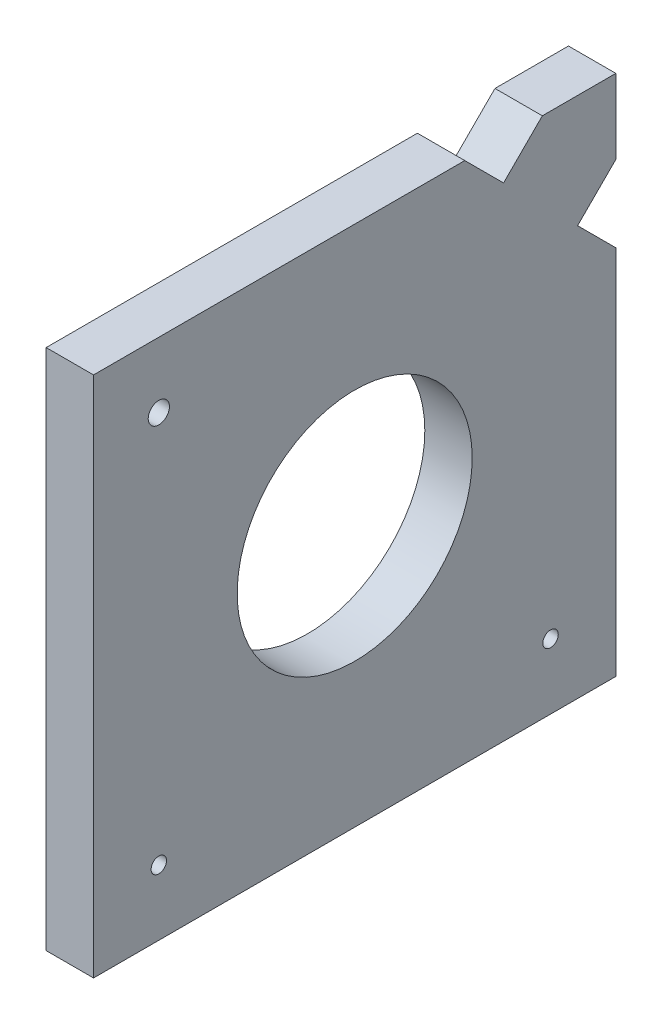
ISO-10303-21;
HEADER;
FILE_DESCRIPTION(('STEP AP214'),'2;1');
FILE_NAME('part.step','',(''),(''),'','','');
FILE_SCHEMA(('AUTOMOTIVE_DESIGN { 1 0 10303 214 1 1 1 1 }'));
ENDSEC;
DATA;
#1=APPLICATION_CONTEXT('core data for automotive mechanical design processes');
#2=APPLICATION_PROTOCOL_DEFINITION('international standard','automotive_design',2000,#1);
#3=PRODUCT_CONTEXT('',#1,'mechanical');
#4=PRODUCT('Part','Part','',(#3));
#5=PRODUCT_RELATED_PRODUCT_CATEGORY('part','',(#4));
#6=PRODUCT_DEFINITION_FORMATION('','',#4);
#7=PRODUCT_DEFINITION_CONTEXT('part definition',#1,'design');
#8=PRODUCT_DEFINITION('design','',#6,#7);
#9=PRODUCT_DEFINITION_SHAPE('','',#8);
#10=(LENGTH_UNIT() NAMED_UNIT(*) SI_UNIT(.MILLI.,.METRE.));
#11=(NAMED_UNIT(*) PLANE_ANGLE_UNIT() SI_UNIT($,.RADIAN.));
#12=(NAMED_UNIT(*) SI_UNIT($,.STERADIAN.) SOLID_ANGLE_UNIT());
#13=UNCERTAINTY_MEASURE_WITH_UNIT(LENGTH_MEASURE(1.E-05),#10,'distance_accuracy_value','');
#14=(GEOMETRIC_REPRESENTATION_CONTEXT(3) GLOBAL_UNCERTAINTY_ASSIGNED_CONTEXT((#13)) GLOBAL_UNIT_ASSIGNED_CONTEXT((#10,
#11,#12)) REPRESENTATION_CONTEXT('',''));
#15=CARTESIAN_POINT('',(0.,0.,0.));
#16=DIRECTION('',(0.,0.,1.));
#17=DIRECTION('',(1.,0.,0.));
#18=AXIS2_PLACEMENT_3D('',#15,#16,#17);
#19=CARTESIAN_POINT('',(6.35,0.,0.));
#20=DIRECTION('',(-1.,0.,0.));
#21=DIRECTION('',(0.,0.,1.));
#22=AXIS2_PLACEMENT_3D('',#19,#20,#21);
#23=PLANE('',#22);
#24=CARTESIAN_POINT('',(6.35,8.75000000000001,-61.25));
#25=DIRECTION('',(1.,0.,0.));
#26=DIRECTION('',(0.,0.,-1.));
#27=AXIS2_PLACEMENT_3D('',#24,#25,#26);
#28=CIRCLE('',#27,1.03251);
#29=CARTESIAN_POINT('',(6.35,8.75000000000001,-62.28251));
#30=VERTEX_POINT('',#29);
#31=EDGE_CURVE('E229',#30,#30,#28,.T.);
#32=ORIENTED_EDGE('',*,*,#31,.F.);
#33=EDGE_LOOP('',(#32));
#34=FACE_BOUND('',#33,.T.);
#35=CARTESIAN_POINT('',(6.35,8.75000000000001,-8.74999999999999));
#36=DIRECTION('',(1.,0.,0.));
#37=DIRECTION('',(0.,0.,1.));
#38=AXIS2_PLACEMENT_3D('',#35,#36,#37);
#39=CIRCLE('',#38,1.03251);
#40=CARTESIAN_POINT('',(6.35,8.75000000000001,-7.71748999999999));
#41=VERTEX_POINT('',#40);
#42=EDGE_CURVE('E223',#41,#41,#39,.T.);
#43=ORIENTED_EDGE('',*,*,#42,.F.);
#44=EDGE_LOOP('',(#43));
#45=FACE_BOUND('',#44,.T.);
#46=CARTESIAN_POINT('',(6.35,61.25,-8.74999999999999));
#47=DIRECTION('',(1.,0.,0.));
#48=DIRECTION('',(0.,0.,-1.));
#49=AXIS2_PLACEMENT_3D('',#46,#47,#48);
#50=CIRCLE('',#49,1.4224);
#51=CARTESIAN_POINT('',(6.35,61.25,-10.1724));
#52=VERTEX_POINT('',#51);
#53=EDGE_CURVE('E217',#52,#52,#50,.T.);
#54=ORIENTED_EDGE('',*,*,#53,.F.);
#55=EDGE_LOOP('',(#54));
#56=FACE_BOUND('',#55,.T.);
#57=DIRECTION('',(0.,-1.,0.));
#58=VECTOR('',#57,1.);
#59=CARTESIAN_POINT('',(6.35,0.,0.));
#60=LINE('',#59,#58);
#61=CARTESIAN_POINT('',(6.35,70.,0.));
#62=VERTEX_POINT('',#61);
#63=CARTESIAN_POINT('',(6.35,0.,0.));
#64=VERTEX_POINT('',#63);
#65=EDGE_CURVE('E163',#62,#64,#60,.T.);
#66=ORIENTED_EDGE('',*,*,#65,.T.);
#67=DIRECTION('',(0.,0.,-1.));
#68=VECTOR('',#67,1.);
#69=CARTESIAN_POINT('',(6.35,0.,0.));
#70=LINE('',#69,#68);
#71=CARTESIAN_POINT('',(6.35,0.,-70.));
#72=VERTEX_POINT('',#71);
#73=EDGE_CURVE('E101',#64,#72,#70,.T.);
#74=ORIENTED_EDGE('',*,*,#73,.T.);
#75=DIRECTION('',(0.,1.,0.));
#76=VECTOR('',#75,1.);
#77=CARTESIAN_POINT('',(6.35,49.7566150142179,-70.));
#78=LINE('',#77,#76);
#79=CARTESIAN_POINT('',(6.35,49.7566150142179,-70.));
#80=VERTEX_POINT('',#79);
#81=EDGE_CURVE('E184',#72,#80,#78,.T.);
#82=ORIENTED_EDGE('',*,*,#81,.T.);
#83=DIRECTION('',(0.,0.707106781186539,0.707106781186556));
#84=VECTOR('',#83,1.);
#85=CARTESIAN_POINT('',(6.35,54.8841313668253,-64.8724836473926));
#86=LINE('',#85,#84);
#87=CARTESIAN_POINT('',(6.35,54.8841313668253,-64.8724836473926));
#88=VERTEX_POINT('',#87);
#89=EDGE_CURVE('E203',#80,#88,#86,.T.);
#90=ORIENTED_EDGE('',*,*,#89,.T.);
#91=DIRECTION('',(0.,0.707106781186557,-0.707106781186538));
#92=VECTOR('',#91,1.);
#93=CARTESIAN_POINT('',(6.35,60.0116477194329,-70.));
#94=LINE('',#93,#92);
#95=CARTESIAN_POINT('',(6.35,60.0116477194329,-70.));
#96=VERTEX_POINT('',#95);
#97=EDGE_CURVE('E200',#88,#96,#94,.T.);
#98=ORIENTED_EDGE('',*,*,#97,.T.);
#99=DIRECTION('',(0.,1.,0.));
#100=VECTOR('',#99,1.);
#101=CARTESIAN_POINT('',(6.35,70.,-70.));
#102=LINE('',#101,#100);
#103=CARTESIAN_POINT('',(6.35,70.,-70.));
#104=VERTEX_POINT('',#103);
#105=EDGE_CURVE('E202',#96,#104,#102,.T.);
#106=ORIENTED_EDGE('',*,*,#105,.T.);
#107=DIRECTION('',(0.,0.,1.));
#108=VECTOR('',#107,1.);
#109=CARTESIAN_POINT('',(6.35,70.,-60.1486352668631));
#110=LINE('',#109,#108);
#111=CARTESIAN_POINT('',(6.35,70.,-60.1486352668631));
#112=VERTEX_POINT('',#111);
#113=EDGE_CURVE('E126',#104,#112,#110,.T.);
#114=ORIENTED_EDGE('',*,*,#113,.T.);
#115=DIRECTION('',(0.,-0.707106781186557,0.707106781186538));
#116=VECTOR('',#115,1.);
#117=CARTESIAN_POINT('',(6.35,64.8039898736772,-54.9526251405404));
#118=LINE('',#117,#116);
#119=CARTESIAN_POINT('',(6.35,64.8039898736772,-54.9526251405404));
#120=VERTEX_POINT('',#119);
#121=EDGE_CURVE('E120',#112,#120,#118,.T.);
#122=ORIENTED_EDGE('',*,*,#121,.T.);
#123=DIRECTION('',(0.,0.707106781186539,0.707106781186556));
#124=VECTOR('',#123,1.);
#125=CARTESIAN_POINT('',(6.35,64.8039898736772,-54.9526251405404));
#126=LINE('',#125,#124);
#127=CARTESIAN_POINT('',(6.35,70.,-49.7566150142174));
#128=VERTEX_POINT('',#127);
#129=EDGE_CURVE('E124',#120,#128,#126,.T.);
#130=ORIENTED_EDGE('',*,*,#129,.T.);
#131=DIRECTION('',(0.,0.,1.));
#132=VECTOR('',#131,1.);
#133=CARTESIAN_POINT('',(6.35,70.,0.));
#134=LINE('',#133,#132);
#135=EDGE_CURVE('E52',#128,#62,#134,.T.);
#136=ORIENTED_EDGE('',*,*,#135,.T.);
#137=EDGE_LOOP('',(#66,#74,#82,#90,#98,#106,#114,#122,#130,#136));
#138=FACE_BOUND('',#137,.T.);
#139=CARTESIAN_POINT('',(6.35,35.,-35.));
#140=DIRECTION('',(1.,0.,0.));
#141=DIRECTION('',(0.,0.,-1.));
#142=AXIS2_PLACEMENT_3D('',#139,#140,#141);
#143=CIRCLE('',#142,15.748);
#144=CARTESIAN_POINT('',(6.35,35.,-50.748));
#145=VERTEX_POINT('',#144);
#146=EDGE_CURVE('E148',#145,#145,#143,.T.);
#147=ORIENTED_EDGE('',*,*,#146,.F.);
#148=EDGE_LOOP('',(#147));
#149=FACE_BOUND('',#148,.T.);
#150=ADVANCED_FACE('F35',(#34,#45,#56,#138,#149),#23,.F.);
#151=CARTESIAN_POINT('',(0.,0.,0.));
#152=DIRECTION('',(-1.,0.,0.));
#153=DIRECTION('',(0.,0.,1.));
#154=AXIS2_PLACEMENT_3D('',#151,#152,#153);
#155=PLANE('',#154);
#156=CARTESIAN_POINT('',(0.,8.75000000000001,-61.25));
#157=DIRECTION('',(1.,0.,0.));
#158=DIRECTION('',(0.,0.,-1.));
#159=AXIS2_PLACEMENT_3D('',#156,#157,#158);
#160=CIRCLE('',#159,1.03251);
#161=CARTESIAN_POINT('',(0.,8.75000000000001,-62.28251));
#162=VERTEX_POINT('',#161);
#163=EDGE_CURVE('E226',#162,#162,#160,.T.);
#164=ORIENTED_EDGE('',*,*,#163,.T.);
#165=EDGE_LOOP('',(#164));
#166=FACE_BOUND('',#165,.T.);
#167=CARTESIAN_POINT('',(0.,8.75000000000001,-8.74999999999999));
#168=DIRECTION('',(1.,0.,0.));
#169=DIRECTION('',(0.,0.,1.));
#170=AXIS2_PLACEMENT_3D('',#167,#168,#169);
#171=CIRCLE('',#170,1.03251);
#172=CARTESIAN_POINT('',(0.,8.75000000000001,-7.71748999999999));
#173=VERTEX_POINT('',#172);
#174=EDGE_CURVE('E220',#173,#173,#171,.T.);
#175=ORIENTED_EDGE('',*,*,#174,.T.);
#176=EDGE_LOOP('',(#175));
#177=FACE_BOUND('',#176,.T.);
#178=CARTESIAN_POINT('',(0.,61.25,-8.74999999999999));
#179=DIRECTION('',(1.,0.,0.));
#180=DIRECTION('',(0.,0.,-1.));
#181=AXIS2_PLACEMENT_3D('',#178,#179,#180);
#182=CIRCLE('',#181,1.4224);
#183=CARTESIAN_POINT('',(0.,61.25,-10.1724));
#184=VERTEX_POINT('',#183);
#185=EDGE_CURVE('E214',#184,#184,#182,.T.);
#186=ORIENTED_EDGE('',*,*,#185,.T.);
#187=EDGE_LOOP('',(#186));
#188=FACE_BOUND('',#187,.T.);
#189=DIRECTION('',(0.,-1.,0.));
#190=VECTOR('',#189,1.);
#191=CARTESIAN_POINT('',(0.,0.,0.));
#192=LINE('',#191,#190);
#193=CARTESIAN_POINT('',(0.,70.,0.));
#194=VERTEX_POINT('',#193);
#195=CARTESIAN_POINT('',(0.,0.,0.));
#196=VERTEX_POINT('',#195);
#197=EDGE_CURVE('E144',#194,#196,#192,.T.);
#198=ORIENTED_EDGE('',*,*,#197,.F.);
#199=DIRECTION('',(0.,0.,1.));
#200=VECTOR('',#199,1.);
#201=CARTESIAN_POINT('',(0.,70.,0.));
#202=LINE('',#201,#200);
#203=CARTESIAN_POINT('',(0.,70.,-49.7566150142174));
#204=VERTEX_POINT('',#203);
#205=EDGE_CURVE('E93',#204,#194,#202,.T.);
#206=ORIENTED_EDGE('',*,*,#205,.F.);
#207=DIRECTION('',(0.,0.707106781186539,0.707106781186556));
#208=VECTOR('',#207,1.);
#209=CARTESIAN_POINT('',(0.,64.8039898736772,-54.9526251405404));
#210=LINE('',#209,#208);
#211=CARTESIAN_POINT('',(0.,64.8039898736772,-54.9526251405404));
#212=VERTEX_POINT('',#211);
#213=EDGE_CURVE('E87',#212,#204,#210,.T.);
#214=ORIENTED_EDGE('',*,*,#213,.F.);
#215=DIRECTION('',(0.,-0.707106781186557,0.707106781186538));
#216=VECTOR('',#215,1.);
#217=CARTESIAN_POINT('',(0.,64.8039898736772,-54.9526251405404));
#218=LINE('',#217,#216);
#219=CARTESIAN_POINT('',(0.,70.,-60.1486352668631));
#220=VERTEX_POINT('',#219);
#221=EDGE_CURVE('E134',#220,#212,#218,.T.);
#222=ORIENTED_EDGE('',*,*,#221,.F.);
#223=DIRECTION('',(0.,0.,1.));
#224=VECTOR('',#223,1.);
#225=CARTESIAN_POINT('',(0.,70.,-60.1486352668631));
#226=LINE('',#225,#224);
#227=CARTESIAN_POINT('',(0.,70.,-70.));
#228=VERTEX_POINT('',#227);
#229=EDGE_CURVE('E158',#228,#220,#226,.T.);
#230=ORIENTED_EDGE('',*,*,#229,.F.);
#231=DIRECTION('',(0.,1.,0.));
#232=VECTOR('',#231,1.);
#233=CARTESIAN_POINT('',(0.,70.,-70.));
#234=LINE('',#233,#232);
#235=CARTESIAN_POINT('',(0.,60.0116477194329,-70.));
#236=VERTEX_POINT('',#235);
#237=EDGE_CURVE('E156',#236,#228,#234,.T.);
#238=ORIENTED_EDGE('',*,*,#237,.F.);
#239=DIRECTION('',(0.,0.707106781186557,-0.707106781186538));
#240=VECTOR('',#239,1.);
#241=CARTESIAN_POINT('',(0.,60.0116477194329,-70.));
#242=LINE('',#241,#240);
#243=CARTESIAN_POINT('',(0.,54.8841313668253,-64.8724836473926));
#244=VERTEX_POINT('',#243);
#245=EDGE_CURVE('E154',#244,#236,#242,.T.);
#246=ORIENTED_EDGE('',*,*,#245,.F.);
#247=DIRECTION('',(0.,0.707106781186539,0.707106781186556));
#248=VECTOR('',#247,1.);
#249=CARTESIAN_POINT('',(0.,54.8841313668253,-64.8724836473926));
#250=LINE('',#249,#248);
#251=CARTESIAN_POINT('',(0.,49.7566150142179,-70.));
#252=VERTEX_POINT('',#251);
#253=EDGE_CURVE('E152',#252,#244,#250,.T.);
#254=ORIENTED_EDGE('',*,*,#253,.F.);
#255=DIRECTION('',(0.,1.,0.));
#256=VECTOR('',#255,1.);
#257=CARTESIAN_POINT('',(0.,49.7566150142179,-70.));
#258=LINE('',#257,#256);
#259=CARTESIAN_POINT('',(0.,0.,-70.));
#260=VERTEX_POINT('',#259);
#261=EDGE_CURVE('E150',#260,#252,#258,.T.);
#262=ORIENTED_EDGE('',*,*,#261,.F.);
#263=DIRECTION('',(0.,0.,-1.));
#264=VECTOR('',#263,1.);
#265=CARTESIAN_POINT('',(0.,0.,0.));
#266=LINE('',#265,#264);
#267=EDGE_CURVE('E147',#196,#260,#266,.T.);
#268=ORIENTED_EDGE('',*,*,#267,.F.);
#269=EDGE_LOOP('',(#198,#206,#214,#222,#230,#238,#246,#254,#262,#268));
#270=FACE_BOUND('',#269,.T.);
#271=CARTESIAN_POINT('',(0.,35.,-35.));
#272=DIRECTION('',(1.,0.,0.));
#273=DIRECTION('',(0.,0.,-1.));
#274=AXIS2_PLACEMENT_3D('',#271,#272,#273);
#275=CIRCLE('',#274,15.748);
#276=CARTESIAN_POINT('',(0.,35.,-50.748));
#277=VERTEX_POINT('',#276);
#278=EDGE_CURVE('E211',#277,#277,#275,.T.);
#279=ORIENTED_EDGE('',*,*,#278,.T.);
#280=EDGE_LOOP('',(#279));
#281=FACE_BOUND('',#280,.T.);
#282=ADVANCED_FACE('F188',(#166,#177,#188,#270,#281),#155,.T.);
#283=CARTESIAN_POINT('',(6.35,0.,0.));
#284=DIRECTION('',(0.,0.,-1.));
#285=DIRECTION('',(0.,1.,0.));
#286=AXIS2_PLACEMENT_3D('',#283,#284,#285);
#287=PLANE('',#286);
#288=ORIENTED_EDGE('',*,*,#197,.T.);
#289=DIRECTION('',(-1.,0.,0.));
#290=VECTOR('',#289,1.);
#291=CARTESIAN_POINT('',(6.35,0.,0.));
#292=LINE('',#291,#290);
#293=EDGE_CURVE('E11',#64,#196,#292,.T.);
#294=ORIENTED_EDGE('',*,*,#293,.F.);
#295=ORIENTED_EDGE('',*,*,#65,.F.);
#296=DIRECTION('',(-1.,0.,0.));
#297=VECTOR('',#296,1.);
#298=CARTESIAN_POINT('',(6.35,70.,0.));
#299=LINE('',#298,#297);
#300=EDGE_CURVE('E140',#62,#194,#299,.T.);
#301=ORIENTED_EDGE('',*,*,#300,.T.);
#302=EDGE_LOOP('',(#288,#294,#295,#301));
#303=FACE_BOUND('',#302,.T.);
#304=ADVANCED_FACE('F37',(#303),#287,.F.);
#305=CARTESIAN_POINT('',(6.35,0.,0.));
#306=DIRECTION('',(0.,1.,0.));
#307=DIRECTION('',(0.,0.,1.));
#308=AXIS2_PLACEMENT_3D('',#305,#306,#307);
#309=PLANE('',#308);
#310=ORIENTED_EDGE('',*,*,#267,.T.);
#311=DIRECTION('',(-1.,0.,0.));
#312=VECTOR('',#311,1.);
#313=CARTESIAN_POINT('',(6.35,0.,-70.));
#314=LINE('',#313,#312);
#315=EDGE_CURVE('E44',#72,#260,#314,.T.);
#316=ORIENTED_EDGE('',*,*,#315,.F.);
#317=ORIENTED_EDGE('',*,*,#73,.F.);
#318=ORIENTED_EDGE('',*,*,#293,.T.);
#319=EDGE_LOOP('',(#310,#316,#317,#318));
#320=FACE_BOUND('',#319,.T.);
#321=ADVANCED_FACE('F288',(#320),#309,.F.);
#322=CARTESIAN_POINT('',(6.35,49.7566150142179,-70.));
#323=DIRECTION('',(0.,0.,1.));
#324=DIRECTION('',(1.,0.,0.));
#325=AXIS2_PLACEMENT_3D('',#322,#323,#324);
#326=PLANE('',#325);
#327=ORIENTED_EDGE('',*,*,#261,.T.);
#328=DIRECTION('',(-1.,0.,0.));
#329=VECTOR('',#328,1.);
#330=CARTESIAN_POINT('',(6.35,49.7566150142179,-70.));
#331=LINE('',#330,#329);
#332=EDGE_CURVE('E176',#80,#252,#331,.T.);
#333=ORIENTED_EDGE('',*,*,#332,.F.);
#334=ORIENTED_EDGE('',*,*,#81,.F.);
#335=ORIENTED_EDGE('',*,*,#315,.T.);
#336=EDGE_LOOP('',(#327,#333,#334,#335));
#337=FACE_BOUND('',#336,.T.);
#338=ADVANCED_FACE('F182',(#337),#326,.F.);
#339=CARTESIAN_POINT('',(6.35,54.8841313668253,-64.8724836473926));
#340=DIRECTION('',(0.,-0.707106781186556,0.707106781186539));
#341=DIRECTION('',(0.,-0.707106781186539,-0.707106781186556));
#342=AXIS2_PLACEMENT_3D('',#339,#340,#341);
#343=PLANE('',#342);
#344=ORIENTED_EDGE('',*,*,#253,.T.);
#345=DIRECTION('',(-1.,0.,0.));
#346=VECTOR('',#345,1.);
#347=CARTESIAN_POINT('',(6.35,54.8841313668253,-64.8724836473926));
#348=LINE('',#347,#346);
#349=EDGE_CURVE('E173',#88,#244,#348,.T.);
#350=ORIENTED_EDGE('',*,*,#349,.F.);
#351=ORIENTED_EDGE('',*,*,#89,.F.);
#352=ORIENTED_EDGE('',*,*,#332,.T.);
#353=EDGE_LOOP('',(#344,#350,#351,#352));
#354=FACE_BOUND('',#353,.T.);
#355=ADVANCED_FACE('F194',(#354),#343,.F.);
#356=CARTESIAN_POINT('',(6.35,60.0116477194329,-70.));
#357=DIRECTION('',(0.,0.707106781186538,0.707106781186557));
#358=DIRECTION('',(0.,-0.707106781186557,0.707106781186538));
#359=AXIS2_PLACEMENT_3D('',#356,#357,#358);
#360=PLANE('',#359);
#361=ORIENTED_EDGE('',*,*,#245,.T.);
#362=DIRECTION('',(-1.,0.,0.));
#363=VECTOR('',#362,1.);
#364=CARTESIAN_POINT('',(6.35,60.0116477194329,-70.));
#365=LINE('',#364,#363);
#366=EDGE_CURVE('E170',#96,#236,#365,.T.);
#367=ORIENTED_EDGE('',*,*,#366,.F.);
#368=ORIENTED_EDGE('',*,*,#97,.F.);
#369=ORIENTED_EDGE('',*,*,#349,.T.);
#370=EDGE_LOOP('',(#361,#367,#368,#369));
#371=FACE_BOUND('',#370,.T.);
#372=ADVANCED_FACE('F198',(#371),#360,.F.);
#373=CARTESIAN_POINT('',(6.35,70.,-70.));
#374=DIRECTION('',(0.,0.,1.));
#375=DIRECTION('',(1.,0.,0.));
#376=AXIS2_PLACEMENT_3D('',#373,#374,#375);
#377=PLANE('',#376);
#378=ORIENTED_EDGE('',*,*,#237,.T.);
#379=DIRECTION('',(-1.,0.,0.));
#380=VECTOR('',#379,1.);
#381=CARTESIAN_POINT('',(6.35,70.,-70.));
#382=LINE('',#381,#380);
#383=EDGE_CURVE('E167',#104,#228,#382,.T.);
#384=ORIENTED_EDGE('',*,*,#383,.F.);
#385=ORIENTED_EDGE('',*,*,#105,.F.);
#386=ORIENTED_EDGE('',*,*,#366,.T.);
#387=EDGE_LOOP('',(#378,#384,#385,#386));
#388=FACE_BOUND('',#387,.T.);
#389=ADVANCED_FACE('F278',(#388),#377,.F.);
#390=CARTESIAN_POINT('',(6.35,70.,-60.1486352668631));
#391=DIRECTION('',(0.,-1.,0.));
#392=DIRECTION('',(0.,0.,-1.));
#393=AXIS2_PLACEMENT_3D('',#390,#391,#392);
#394=PLANE('',#393);
#395=ORIENTED_EDGE('',*,*,#229,.T.);
#396=DIRECTION('',(-1.,0.,0.));
#397=VECTOR('',#396,1.);
#398=CARTESIAN_POINT('',(6.35,70.,-60.1486352668631));
#399=LINE('',#398,#397);
#400=EDGE_CURVE('E135',#112,#220,#399,.T.);
#401=ORIENTED_EDGE('',*,*,#400,.F.);
#402=ORIENTED_EDGE('',*,*,#113,.F.);
#403=ORIENTED_EDGE('',*,*,#383,.T.);
#404=EDGE_LOOP('',(#395,#401,#402,#403));
#405=FACE_BOUND('',#404,.T.);
#406=ADVANCED_FACE('F275',(#405),#394,.F.);
#407=CARTESIAN_POINT('',(6.35,64.8039898736772,-54.9526251405404));
#408=DIRECTION('',(0.,-0.707106781186538,-0.707106781186557));
#409=DIRECTION('',(0.,0.707106781186557,-0.707106781186538));
#410=AXIS2_PLACEMENT_3D('',#407,#408,#409);
#411=PLANE('',#410);
#412=ORIENTED_EDGE('',*,*,#221,.T.);
#413=DIRECTION('',(-1.,0.,0.));
#414=VECTOR('',#413,1.);
#415=CARTESIAN_POINT('',(6.35,64.8039898736772,-54.9526251405404));
#416=LINE('',#415,#414);
#417=EDGE_CURVE('E131',#120,#212,#416,.T.);
#418=ORIENTED_EDGE('',*,*,#417,.F.);
#419=ORIENTED_EDGE('',*,*,#121,.F.);
#420=ORIENTED_EDGE('',*,*,#400,.T.);
#421=EDGE_LOOP('',(#412,#418,#419,#420));
#422=FACE_BOUND('',#421,.T.);
#423=ADVANCED_FACE('F132',(#422),#411,.F.);
#424=CARTESIAN_POINT('',(6.35,64.8039898736772,-54.9526251405404));
#425=DIRECTION('',(0.,-0.707106781186556,0.707106781186539));
#426=DIRECTION('',(0.,-0.707106781186539,-0.707106781186556));
#427=AXIS2_PLACEMENT_3D('',#424,#425,#426);
#428=PLANE('',#427);
#429=ORIENTED_EDGE('',*,*,#213,.T.);
#430=DIRECTION('',(-1.,0.,0.));
#431=VECTOR('',#430,1.);
#432=CARTESIAN_POINT('',(6.35,70.,-49.7566150142174));
#433=LINE('',#432,#431);
#434=EDGE_CURVE('E136',#128,#204,#433,.T.);
#435=ORIENTED_EDGE('',*,*,#434,.F.);
#436=ORIENTED_EDGE('',*,*,#129,.F.);
#437=ORIENTED_EDGE('',*,*,#417,.T.);
#438=EDGE_LOOP('',(#429,#435,#436,#437));
#439=FACE_BOUND('',#438,.T.);
#440=ADVANCED_FACE('F138',(#439),#428,.F.);
#441=CARTESIAN_POINT('',(6.35,70.,0.));
#442=DIRECTION('',(0.,-1.,0.));
#443=DIRECTION('',(0.,0.,-1.));
#444=AXIS2_PLACEMENT_3D('',#441,#442,#443);
#445=PLANE('',#444);
#446=ORIENTED_EDGE('',*,*,#205,.T.);
#447=ORIENTED_EDGE('',*,*,#300,.F.);
#448=ORIENTED_EDGE('',*,*,#135,.F.);
#449=ORIENTED_EDGE('',*,*,#434,.T.);
#450=EDGE_LOOP('',(#446,#447,#448,#449));
#451=FACE_BOUND('',#450,.T.);
#452=ADVANCED_FACE('F262',(#451),#445,.F.);
#453=CARTESIAN_POINT('',(6.35,35.,-35.));
#454=DIRECTION('',(-1.,0.,0.));
#455=DIRECTION('',(0.,0.,1.));
#456=AXIS2_PLACEMENT_3D('',#453,#454,#455);
#457=CYLINDRICAL_SURFACE('',#456,15.748);
#458=ORIENTED_EDGE('',*,*,#146,.T.);
#459=EDGE_LOOP('',(#458));
#460=FACE_BOUND('',#459,.T.);
#461=ORIENTED_EDGE('',*,*,#278,.F.);
#462=EDGE_LOOP('',(#461));
#463=FACE_BOUND('',#462,.T.);
#464=ADVANCED_FACE('F253',(#460,#463),#457,.F.);
#465=CARTESIAN_POINT('',(0.,61.25,-8.74999999999999));
#466=DIRECTION('',(1.,0.,0.));
#467=DIRECTION('',(0.,0.,-1.));
#468=AXIS2_PLACEMENT_3D('',#465,#466,#467);
#469=CYLINDRICAL_SURFACE('',#468,1.4224);
#470=ORIENTED_EDGE('',*,*,#185,.F.);
#471=EDGE_LOOP('',(#470));
#472=FACE_BOUND('',#471,.T.);
#473=ORIENTED_EDGE('',*,*,#53,.T.);
#474=EDGE_LOOP('',(#473));
#475=FACE_BOUND('',#474,.T.);
#476=ADVANCED_FACE('F251',(#472,#475),#469,.F.);
#477=CARTESIAN_POINT('',(0.,8.75000000000001,-8.74999999999999));
#478=DIRECTION('',(1.,0.,0.));
#479=DIRECTION('',(0.,0.,-1.));
#480=AXIS2_PLACEMENT_3D('',#477,#478,#479);
#481=CYLINDRICAL_SURFACE('',#480,1.03251);
#482=ORIENTED_EDGE('',*,*,#174,.F.);
#483=EDGE_LOOP('',(#482));
#484=FACE_BOUND('',#483,.T.);
#485=ORIENTED_EDGE('',*,*,#42,.T.);
#486=EDGE_LOOP('',(#485));
#487=FACE_BOUND('',#486,.T.);
#488=ADVANCED_FACE('F240',(#484,#487),#481,.F.);
#489=CARTESIAN_POINT('',(0.,8.75000000000001,-61.25));
#490=DIRECTION('',(1.,0.,0.));
#491=DIRECTION('',(0.,0.,-1.));
#492=AXIS2_PLACEMENT_3D('',#489,#490,#491);
#493=CYLINDRICAL_SURFACE('',#492,1.03251);
#494=ORIENTED_EDGE('',*,*,#163,.F.);
#495=EDGE_LOOP('',(#494));
#496=FACE_BOUND('',#495,.T.);
#497=ORIENTED_EDGE('',*,*,#31,.T.);
#498=EDGE_LOOP('',(#497));
#499=FACE_BOUND('',#498,.T.);
#500=ADVANCED_FACE('F237',(#496,#499),#493,.F.);
#501=CLOSED_SHELL('',(#150,#282,#304,#321,#338,#355,#372,#389,#406,#423,#440,#452,#464,#476,
#488,#500));
#502=MANIFOLD_SOLID_BREP('B2',#501);
#503=ADVANCED_BREP_SHAPE_REPRESENTATION('',(#18,#502),#14);
#504=SHAPE_DEFINITION_REPRESENTATION(#9,#503);
ENDSEC;
END-ISO-10303-21;
